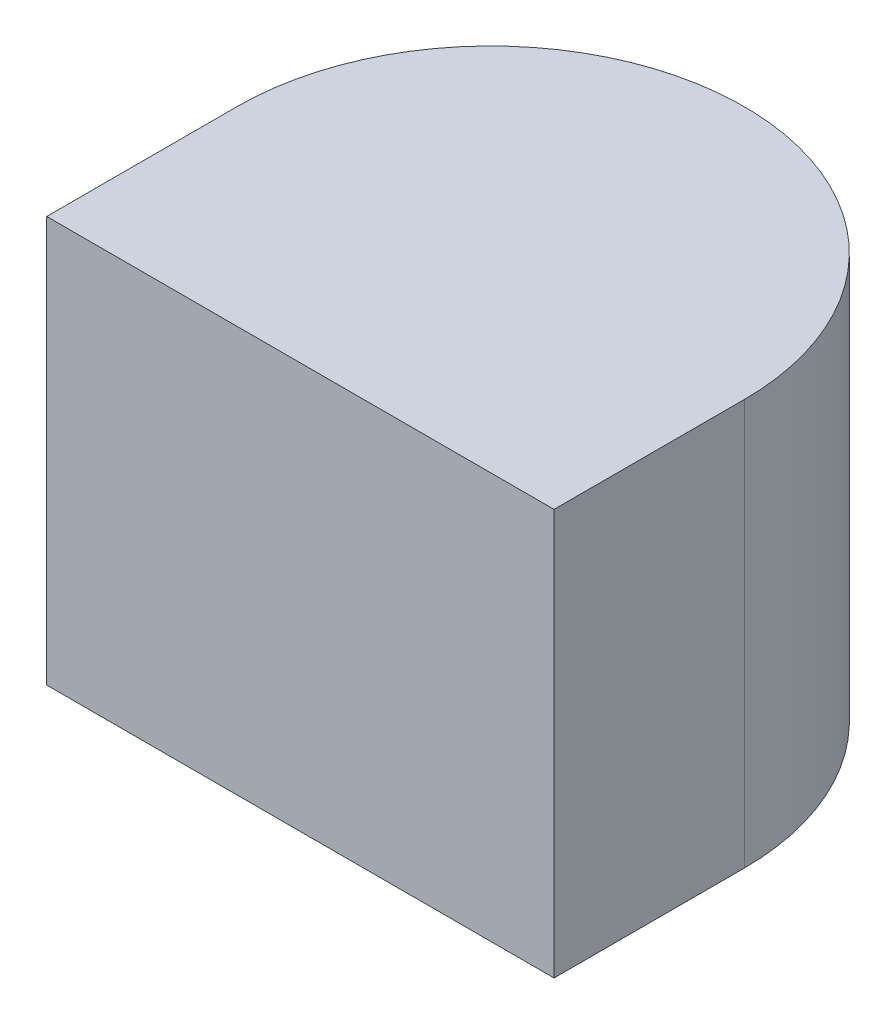
ISO-10303-21;
HEADER;
FILE_DESCRIPTION(('STEP AP214'),'2;1');
FILE_NAME('part.step','',(''),(''),'','','');
FILE_SCHEMA(('AUTOMOTIVE_DESIGN { 1 0 10303 214 1 1 1 1 }'));
ENDSEC;
DATA;
#1=APPLICATION_CONTEXT('core data for automotive mechanical design processes');
#2=APPLICATION_PROTOCOL_DEFINITION('international standard','automotive_design',2000,#1);
#3=PRODUCT_CONTEXT('',#1,'mechanical');
#4=PRODUCT('Part','Part','',(#3));
#5=PRODUCT_RELATED_PRODUCT_CATEGORY('part','',(#4));
#6=PRODUCT_DEFINITION_FORMATION('','',#4);
#7=PRODUCT_DEFINITION_CONTEXT('part definition',#1,'design');
#8=PRODUCT_DEFINITION('design','',#6,#7);
#9=PRODUCT_DEFINITION_SHAPE('','',#8);
#10=(LENGTH_UNIT() NAMED_UNIT(*) SI_UNIT(.MILLI.,.METRE.));
#11=(NAMED_UNIT(*) PLANE_ANGLE_UNIT() SI_UNIT($,.RADIAN.));
#12=(NAMED_UNIT(*) SI_UNIT($,.STERADIAN.) SOLID_ANGLE_UNIT());
#13=UNCERTAINTY_MEASURE_WITH_UNIT(LENGTH_MEASURE(1.E-05),#10,'distance_accuracy_value','');
#14=(GEOMETRIC_REPRESENTATION_CONTEXT(3) GLOBAL_UNCERTAINTY_ASSIGNED_CONTEXT((#13)) GLOBAL_UNIT_ASSIGNED_CONTEXT((#10,
#11,#12)) REPRESENTATION_CONTEXT('',''));
#15=CARTESIAN_POINT('',(0.,0.,0.));
#16=DIRECTION('',(0.,0.,1.));
#17=DIRECTION('',(1.,0.,0.));
#18=AXIS2_PLACEMENT_3D('',#15,#16,#17);
#19=CARTESIAN_POINT('',(1.27,3.468427124746,4.78));
#20=DIRECTION('',(0.,-1.,0.));
#21=DIRECTION('',(0.,0.,-1.));
#22=AXIS2_PLACEMENT_3D('',#19,#20,#21);
#23=CYLINDRICAL_SURFACE('',#22,0.4);
#24=CARTESIAN_POINT('',(1.27,0.,4.78));
#25=DIRECTION('',(0.,-1.,0.));
#26=DIRECTION('',(0.,0.,-1.));
#27=AXIS2_PLACEMENT_3D('',#24,#25,#26);
#28=CIRCLE('',#27,0.4);
#29=CARTESIAN_POINT('',(1.67,0.,4.78));
#30=VERTEX_POINT('',#29);
#31=CARTESIAN_POINT('',(0.870000000000001,0.,4.78));
#32=VERTEX_POINT('',#31);
#33=EDGE_CURVE('E20',#30,#32,#28,.F.);
#34=ORIENTED_EDGE('',*,*,#33,.T.);
#35=DIRECTION('',(0.,1.,0.));
#36=VECTOR('',#35,1.);
#37=CARTESIAN_POINT('',(0.870000000000001,3.468427124746,4.78));
#38=LINE('',#37,#36);
#39=CARTESIAN_POINT('',(0.870000000000001,0.64,4.78));
#40=VERTEX_POINT('',#39);
#41=EDGE_CURVE('E88',#32,#40,#38,.T.);
#42=ORIENTED_EDGE('',*,*,#41,.T.);
#43=CARTESIAN_POINT('',(1.27,0.64,4.78));
#44=DIRECTION('',(0.,-1.,0.));
#45=DIRECTION('',(0.,0.,-1.));
#46=AXIS2_PLACEMENT_3D('',#43,#44,#45);
#47=CIRCLE('',#46,0.4);
#48=CARTESIAN_POINT('',(1.67,0.64,4.78));
#49=VERTEX_POINT('',#48);
#50=EDGE_CURVE('E65',#49,#40,#47,.F.);
#51=ORIENTED_EDGE('',*,*,#50,.F.);
#52=DIRECTION('',(0.,1.,0.));
#53=VECTOR('',#52,1.);
#54=CARTESIAN_POINT('',(1.67,3.468427124746,4.78));
#55=LINE('',#54,#53);
#56=EDGE_CURVE('E64',#49,#30,#55,.F.);
#57=ORIENTED_EDGE('',*,*,#56,.T.);
#58=EDGE_LOOP('',(#34,#42,#51,#57));
#59=FACE_BOUND('',#58,.T.);
#60=ADVANCED_FACE('F17',(#59),#23,.T.);
#61=CARTESIAN_POINT('',(1.67,3.468427124746,5.08));
#62=DIRECTION('',(-1.,0.,0.));
#63=DIRECTION('',(0.,0.,1.));
#64=AXIS2_PLACEMENT_3D('',#61,#62,#63);
#65=PLANE('',#64);
#66=DIRECTION('',(0.,1.,0.));
#67=VECTOR('',#66,1.);
#68=CARTESIAN_POINT('',(1.67,3.468427124746,5.08));
#69=LINE('',#68,#67);
#70=CARTESIAN_POINT('',(1.67,0.64,5.08));
#71=VERTEX_POINT('',#70);
#72=CARTESIAN_POINT('',(1.67,0.,5.08));
#73=VERTEX_POINT('',#72);
#74=EDGE_CURVE('E73',#71,#73,#69,.F.);
#75=ORIENTED_EDGE('',*,*,#74,.T.);
#76=DIRECTION('',(0.,0.,1.));
#77=VECTOR('',#76,1.);
#78=CARTESIAN_POINT('',(1.67,0.,4.78));
#79=LINE('',#78,#77);
#80=EDGE_CURVE('E60',#73,#30,#79,.F.);
#81=ORIENTED_EDGE('',*,*,#80,.T.);
#82=ORIENTED_EDGE('',*,*,#56,.F.);
#83=DIRECTION('',(0.,0.,1.));
#84=VECTOR('',#83,1.);
#85=CARTESIAN_POINT('',(1.67,0.64,0.));
#86=LINE('',#85,#84);
#87=EDGE_CURVE('E83',#71,#49,#86,.F.);
#88=ORIENTED_EDGE('',*,*,#87,.F.);
#89=EDGE_LOOP('',(#75,#81,#82,#88));
#90=FACE_BOUND('',#89,.T.);
#91=ADVANCED_FACE('F71',(#90),#65,.F.);
#92=CARTESIAN_POINT('',(1.27,0.,4.78));
#93=DIRECTION('',(0.,1.,0.));
#94=DIRECTION('',(0.,0.,1.));
#95=AXIS2_PLACEMENT_3D('',#92,#93,#94);
#96=PLANE('',#95);
#97=ORIENTED_EDGE('',*,*,#33,.F.);
#98=ORIENTED_EDGE('',*,*,#80,.F.);
#99=DIRECTION('',(-1.,0.,0.));
#100=VECTOR('',#99,1.);
#101=CARTESIAN_POINT('',(0.87,0.,5.08));
#102=LINE('',#101,#100);
#103=CARTESIAN_POINT('',(0.87,0.,5.08));
#104=VERTEX_POINT('',#103);
#105=EDGE_CURVE('E82',#73,#104,#102,.T.);
#106=ORIENTED_EDGE('',*,*,#105,.T.);
#107=DIRECTION('',(0.,0.,-1.));
#108=VECTOR('',#107,1.);
#109=CARTESIAN_POINT('',(0.87,0.,5.08));
#110=LINE('',#109,#108);
#111=EDGE_CURVE('E62',#104,#32,#110,.T.);
#112=ORIENTED_EDGE('',*,*,#111,.T.);
#113=EDGE_LOOP('',(#97,#98,#106,#112));
#114=FACE_BOUND('',#113,.T.);
#115=ADVANCED_FACE('F57',(#114),#96,.F.);
#116=CARTESIAN_POINT('',(0.87,3.468427124746,5.08));
#117=DIRECTION('',(1.,0.,0.));
#118=DIRECTION('',(0.,0.,-1.));
#119=AXIS2_PLACEMENT_3D('',#116,#117,#118);
#120=PLANE('',#119);
#121=ORIENTED_EDGE('',*,*,#41,.F.);
#122=ORIENTED_EDGE('',*,*,#111,.F.);
#123=DIRECTION('',(0.,1.,0.));
#124=VECTOR('',#123,1.);
#125=CARTESIAN_POINT('',(0.87,3.468427124746,5.08));
#126=LINE('',#125,#124);
#127=CARTESIAN_POINT('',(0.87,0.64,5.08));
#128=VERTEX_POINT('',#127);
#129=EDGE_CURVE('E26',#104,#128,#126,.T.);
#130=ORIENTED_EDGE('',*,*,#129,.T.);
#131=DIRECTION('',(0.,0.,1.));
#132=VECTOR('',#131,1.);
#133=CARTESIAN_POINT('',(0.87,0.64,0.));
#134=LINE('',#133,#132);
#135=EDGE_CURVE('E34',#40,#128,#134,.T.);
#136=ORIENTED_EDGE('',*,*,#135,.F.);
#137=EDGE_LOOP('',(#121,#122,#130,#136));
#138=FACE_BOUND('',#137,.T.);
#139=ADVANCED_FACE('F107',(#138),#120,.F.);
#140=CARTESIAN_POINT('',(0.,0.64,0.));
#141=DIRECTION('',(0.,1.,0.));
#142=DIRECTION('',(0.,0.,1.));
#143=AXIS2_PLACEMENT_3D('',#140,#141,#142);
#144=PLANE('',#143);
#145=DIRECTION('',(-1.,0.,0.));
#146=VECTOR('',#145,1.);
#147=CARTESIAN_POINT('',(0.87,0.64,5.08));
#148=LINE('',#147,#146);
#149=EDGE_CURVE('E11',#128,#71,#148,.F.);
#150=ORIENTED_EDGE('',*,*,#149,.T.);
#151=ORIENTED_EDGE('',*,*,#87,.T.);
#152=ORIENTED_EDGE('',*,*,#50,.T.);
#153=ORIENTED_EDGE('',*,*,#135,.T.);
#154=EDGE_LOOP('',(#150,#151,#152,#153));
#155=FACE_BOUND('',#154,.T.);
#156=ADVANCED_FACE('F102',(#155),#144,.T.);
#157=CARTESIAN_POINT('',(0.87,3.468427124746,5.08));
#158=DIRECTION('',(0.,0.,-1.));
#159=DIRECTION('',(-1.,0.,0.));
#160=AXIS2_PLACEMENT_3D('',#157,#158,#159);
#161=PLANE('',#160);
#162=ORIENTED_EDGE('',*,*,#129,.F.);
#163=ORIENTED_EDGE('',*,*,#105,.F.);
#164=ORIENTED_EDGE('',*,*,#74,.F.);
#165=ORIENTED_EDGE('',*,*,#149,.F.);
#166=EDGE_LOOP('',(#162,#163,#164,#165));
#167=FACE_BOUND('',#166,.T.);
#168=ADVANCED_FACE('F105',(#167),#161,.F.);
#169=CLOSED_SHELL('',(#60,#91,#115,#139,#156,#168));
#170=MANIFOLD_SOLID_BREP('B1',#169);
#171=ADVANCED_BREP_SHAPE_REPRESENTATION('',(#18,#170),#14);
#172=SHAPE_DEFINITION_REPRESENTATION(#9,#171);
ENDSEC;
END-ISO-10303-21;
